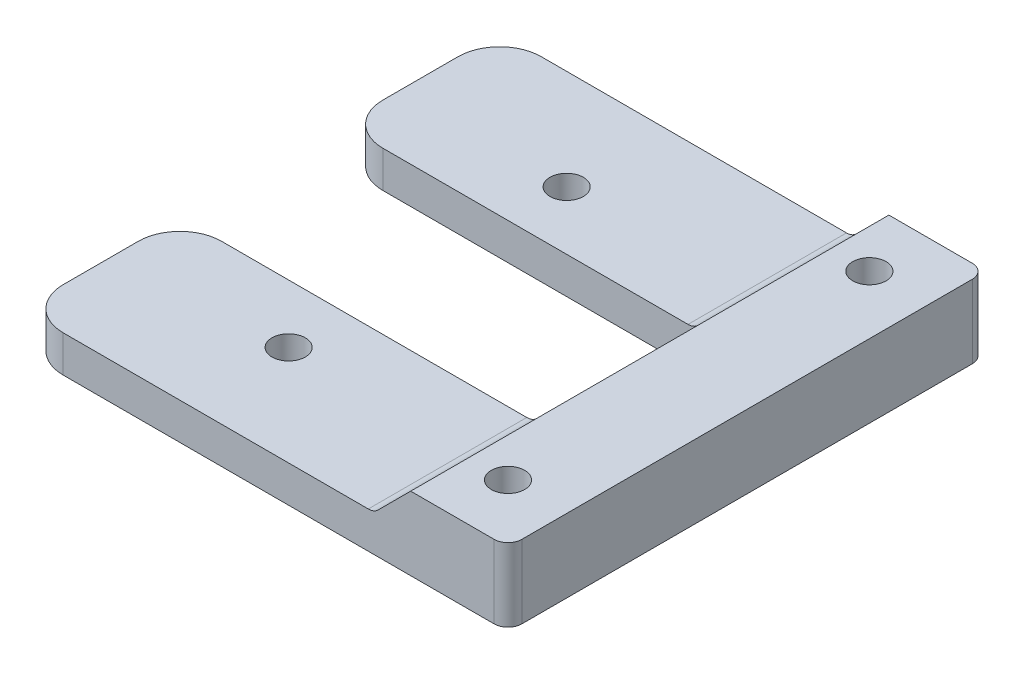
ISO-10303-21;
HEADER;
FILE_DESCRIPTION(('STEP AP214'),'2;1');
FILE_NAME('part.step','',(''),(''),'','','');
FILE_SCHEMA(('AUTOMOTIVE_DESIGN { 1 0 10303 214 1 1 1 1 }'));
ENDSEC;
DATA;
#1=APPLICATION_CONTEXT('core data for automotive mechanical design processes');
#2=APPLICATION_PROTOCOL_DEFINITION('international standard','automotive_design',2000,#1);
#3=PRODUCT_CONTEXT('',#1,'mechanical');
#4=PRODUCT('Part','Part','',(#3));
#5=PRODUCT_RELATED_PRODUCT_CATEGORY('part','',(#4));
#6=PRODUCT_DEFINITION_FORMATION('','',#4);
#7=PRODUCT_DEFINITION_CONTEXT('part definition',#1,'design');
#8=PRODUCT_DEFINITION('design','',#6,#7);
#9=PRODUCT_DEFINITION_SHAPE('','',#8);
#10=(LENGTH_UNIT() NAMED_UNIT(*) SI_UNIT(.MILLI.,.METRE.));
#11=(NAMED_UNIT(*) PLANE_ANGLE_UNIT() SI_UNIT($,.RADIAN.));
#12=(NAMED_UNIT(*) SI_UNIT($,.STERADIAN.) SOLID_ANGLE_UNIT());
#13=UNCERTAINTY_MEASURE_WITH_UNIT(LENGTH_MEASURE(1.E-05),#10,'distance_accuracy_value','');
#14=(GEOMETRIC_REPRESENTATION_CONTEXT(3) GLOBAL_UNCERTAINTY_ASSIGNED_CONTEXT((#13)) GLOBAL_UNIT_ASSIGNED_CONTEXT((#10,
#11,#12)) REPRESENTATION_CONTEXT('',''));
#15=CARTESIAN_POINT('',(0.,0.,0.));
#16=DIRECTION('',(0.,0.,1.));
#17=DIRECTION('',(1.,0.,0.));
#18=AXIS2_PLACEMENT_3D('',#15,#16,#17);
#19=CARTESIAN_POINT('',(0.,-2.635,17.2));
#20=DIRECTION('',(0.,-1.,0.));
#21=DIRECTION('',(1.,0.,0.));
#22=AXIS2_PLACEMENT_3D('',#19,#20,#21);
#23=PLANE('',#22);
#24=CARTESIAN_POINT('',(-22.979761,-2.635,10.0000000000004));
#25=DIRECTION('',(0.,1.,0.));
#26=DIRECTION('',(-1.,0.,0.));
#27=AXIS2_PLACEMENT_3D('',#24,#25,#26);
#28=CIRCLE('',#27,1.2);
#29=CARTESIAN_POINT('',(-24.179761,-2.635,10.0000000000004));
#30=VERTEX_POINT('',#29);
#31=EDGE_CURVE('E846',#30,#30,#28,.T.);
#32=ORIENTED_EDGE('',*,*,#31,.F.);
#33=EDGE_LOOP('',(#32));
#34=FACE_BOUND('',#33,.T.);
#35=DIRECTION('',(0.,0.,-1.));
#36=VECTOR('',#35,1.);
#37=CARTESIAN_POINT('',(-35.,-2.63500000000002,17.2));
#38=LINE('',#37,#36);
#39=CARTESIAN_POINT('',(-35.,-2.63500000000002,14.2));
#40=VERTEX_POINT('',#39);
#41=CARTESIAN_POINT('',(-35.,-2.63500000000002,8.8));
#42=VERTEX_POINT('',#41);
#43=EDGE_CURVE('E226',#40,#42,#38,.T.);
#44=ORIENTED_EDGE('',*,*,#43,.F.);
#45=CARTESIAN_POINT('',(-32.,-2.63500000000002,14.2));
#46=DIRECTION('',(0.,-1.,0.));
#47=DIRECTION('',(1.,0.,0.));
#48=AXIS2_PLACEMENT_3D('',#45,#46,#47);
#49=CIRCLE('',#48,3.);
#50=CARTESIAN_POINT('',(-32.,-2.63500000000002,17.2));
#51=VERTEX_POINT('',#50);
#52=EDGE_CURVE('E312',#40,#51,#49,.F.);
#53=ORIENTED_EDGE('',*,*,#52,.T.);
#54=DIRECTION('',(-1.,0.,0.));
#55=VECTOR('',#54,1.);
#56=CARTESIAN_POINT('',(0.,-2.635,17.2));
#57=LINE('',#56,#55);
#58=CARTESIAN_POINT('',(-10.0492135623731,-2.635,17.2));
#59=VERTEX_POINT('',#58);
#60=EDGE_CURVE('E375',#59,#51,#57,.T.);
#61=ORIENTED_EDGE('',*,*,#60,.F.);
#62=DIRECTION('',(0.,0.,1.));
#63=VECTOR('',#62,1.);
#64=CARTESIAN_POINT('',(-10.0492135623731,-2.635,5.8));
#65=LINE('',#64,#63);
#66=CARTESIAN_POINT('',(-10.0492135623731,-2.635,5.8));
#67=VERTEX_POINT('',#66);
#68=EDGE_CURVE('E233',#59,#67,#65,.F.);
#69=ORIENTED_EDGE('',*,*,#68,.T.);
#70=DIRECTION('',(1.,0.,0.));
#71=VECTOR('',#70,1.);
#72=CARTESIAN_POINT('',(-35.,-2.635,5.8));
#73=LINE('',#72,#71);
#74=CARTESIAN_POINT('',(-32.,-2.635,5.8));
#75=VERTEX_POINT('',#74);
#76=EDGE_CURVE('E432',#75,#67,#73,.T.);
#77=ORIENTED_EDGE('',*,*,#76,.F.);
#78=CARTESIAN_POINT('',(-32.,-2.63500000000002,8.8));
#79=DIRECTION('',(0.,-1.,0.));
#80=DIRECTION('',(1.,0.,0.));
#81=AXIS2_PLACEMENT_3D('',#78,#79,#80);
#82=CIRCLE('',#81,3.);
#83=EDGE_CURVE('E309',#75,#42,#82,.F.);
#84=ORIENTED_EDGE('',*,*,#83,.T.);
#85=EDGE_LOOP('',(#44,#53,#61,#69,#77,#84));
#86=FACE_BOUND('',#85,.T.);
#87=ADVANCED_FACE('F47',(#34,#86),#23,.F.);
#88=CARTESIAN_POINT('',(-35.,0.,17.2));
#89=DIRECTION('',(1.,0.,0.));
#90=DIRECTION('',(0.,0.,-1.));
#91=AXIS2_PLACEMENT_3D('',#88,#89,#90);
#92=PLANE('',#91);
#93=DIRECTION('',(0.,0.,-1.));
#94=VECTOR('',#93,1.);
#95=CARTESIAN_POINT('',(-35.,-5.27,17.2));
#96=LINE('',#95,#94);
#97=CARTESIAN_POINT('',(-35.,-5.27,14.2));
#98=VERTEX_POINT('',#97);
#99=CARTESIAN_POINT('',(-35.,-5.27,8.8));
#100=VERTEX_POINT('',#99);
#101=EDGE_CURVE('E395',#98,#100,#96,.T.);
#102=ORIENTED_EDGE('',*,*,#101,.F.);
#103=DIRECTION('',(0.,-1.,0.));
#104=VECTOR('',#103,1.);
#105=CARTESIAN_POINT('',(-35.,-2.63500000000002,14.2));
#106=LINE('',#105,#104);
#107=EDGE_CURVE('E306',#98,#40,#106,.F.);
#108=ORIENTED_EDGE('',*,*,#107,.T.);
#109=ORIENTED_EDGE('',*,*,#43,.T.);
#110=DIRECTION('',(0.,1.,0.));
#111=VECTOR('',#110,1.);
#112=CARTESIAN_POINT('',(-35.,0.,8.8));
#113=LINE('',#112,#111);
#114=EDGE_CURVE('E303',#42,#100,#113,.F.);
#115=ORIENTED_EDGE('',*,*,#114,.T.);
#116=EDGE_LOOP('',(#102,#108,#109,#115));
#117=FACE_BOUND('',#116,.T.);
#118=ADVANCED_FACE('F410',(#117),#92,.F.);
#119=CARTESIAN_POINT('',(-22.979761,-2.635,-9.99999999999957));
#120=DIRECTION('',(0.,1.,0.));
#121=DIRECTION('',(-1.,0.,0.));
#122=AXIS2_PLACEMENT_3D('',#119,#120,#121);
#123=CIRCLE('',#122,1.2);
#124=CARTESIAN_POINT('',(-24.179761,-2.635,-9.99999999999957));
#125=VERTEX_POINT('',#124);
#126=EDGE_CURVE('E493',#125,#125,#123,.T.);
#127=ORIENTED_EDGE('',*,*,#126,.F.);
#128=EDGE_LOOP('',(#127));
#129=FACE_BOUND('',#128,.T.);
#130=CARTESIAN_POINT('',(-35.,-2.63500000000002,-8.8));
#131=VERTEX_POINT('',#130);
#132=CARTESIAN_POINT('',(-35.,-2.63500000000002,-14.2));
#133=VERTEX_POINT('',#132);
#134=EDGE_CURVE('E398',#131,#133,#38,.T.);
#135=ORIENTED_EDGE('',*,*,#134,.F.);
#136=CARTESIAN_POINT('',(-32.,-2.63500000000002,-8.8));
#137=DIRECTION('',(0.,-1.,0.));
#138=DIRECTION('',(1.,0.,0.));
#139=AXIS2_PLACEMENT_3D('',#136,#137,#138);
#140=CIRCLE('',#139,3.);
#141=CARTESIAN_POINT('',(-32.,-2.635,-5.8));
#142=VERTEX_POINT('',#141);
#143=EDGE_CURVE('E330',#131,#142,#140,.F.);
#144=ORIENTED_EDGE('',*,*,#143,.T.);
#145=DIRECTION('',(-1.,0.,0.));
#146=VECTOR('',#145,1.);
#147=CARTESIAN_POINT('',(-35.,-2.635,-5.8));
#148=LINE('',#147,#146);
#149=CARTESIAN_POINT('',(-10.0492135623731,-2.635,-5.8));
#150=VERTEX_POINT('',#149);
#151=EDGE_CURVE('E426',#150,#142,#148,.T.);
#152=ORIENTED_EDGE('',*,*,#151,.F.);
#153=DIRECTION('',(0.,0.,1.));
#154=VECTOR('',#153,1.);
#155=CARTESIAN_POINT('',(-10.0492135623731,-2.635,-17.2));
#156=LINE('',#155,#154);
#157=CARTESIAN_POINT('',(-10.0492135623731,-2.635,-17.2));
#158=VERTEX_POINT('',#157);
#159=EDGE_CURVE('E239',#150,#158,#156,.F.);
#160=ORIENTED_EDGE('',*,*,#159,.T.);
#161=DIRECTION('',(-1.,0.,0.));
#162=VECTOR('',#161,1.);
#163=CARTESIAN_POINT('',(0.,-2.635,-17.2));
#164=LINE('',#163,#162);
#165=CARTESIAN_POINT('',(-32.,-2.63500000000002,-17.2));
#166=VERTEX_POINT('',#165);
#167=EDGE_CURVE('E382',#158,#166,#164,.T.);
#168=ORIENTED_EDGE('',*,*,#167,.T.);
#169=CARTESIAN_POINT('',(-32.,-2.63500000000002,-14.2));
#170=DIRECTION('',(0.,-1.,0.));
#171=DIRECTION('',(1.,0.,0.));
#172=AXIS2_PLACEMENT_3D('',#169,#170,#171);
#173=CIRCLE('',#172,3.);
#174=EDGE_CURVE('E327',#166,#133,#173,.F.);
#175=ORIENTED_EDGE('',*,*,#174,.T.);
#176=EDGE_LOOP('',(#135,#144,#152,#160,#168,#175));
#177=FACE_BOUND('',#176,.T.);
#178=ADVANCED_FACE('F477',(#129,#177),#23,.F.);
#179=CARTESIAN_POINT('',(-35.,-5.27,-8.8));
#180=VERTEX_POINT('',#179);
#181=CARTESIAN_POINT('',(-35.,-5.27,-14.2));
#182=VERTEX_POINT('',#181);
#183=EDGE_CURVE('E394',#180,#182,#96,.T.);
#184=ORIENTED_EDGE('',*,*,#183,.F.);
#185=DIRECTION('',(0.,1.,0.));
#186=VECTOR('',#185,1.);
#187=CARTESIAN_POINT('',(-35.,0.,-8.8));
#188=LINE('',#187,#186);
#189=EDGE_CURVE('E323',#180,#131,#188,.T.);
#190=ORIENTED_EDGE('',*,*,#189,.T.);
#191=ORIENTED_EDGE('',*,*,#134,.T.);
#192=DIRECTION('',(0.,-1.,0.));
#193=VECTOR('',#192,1.);
#194=CARTESIAN_POINT('',(-35.,0.,-14.2));
#195=LINE('',#194,#193);
#196=EDGE_CURVE('E319',#133,#182,#195,.T.);
#197=ORIENTED_EDGE('',*,*,#196,.T.);
#198=EDGE_LOOP('',(#184,#190,#191,#197));
#199=FACE_BOUND('',#198,.T.);
#200=ADVANCED_FACE('F482',(#199),#92,.F.);
#201=CARTESIAN_POINT('',(0.,-5.27,17.2));
#202=DIRECTION('',(0.,-1.,0.));
#203=DIRECTION('',(1.,0.,0.));
#204=AXIS2_PLACEMENT_3D('',#201,#202,#203);
#205=PLANE('',#204);
#206=CARTESIAN_POINT('',(-22.979761,-5.27,10.0000000000004));
#207=DIRECTION('',(0.,-1.,0.));
#208=DIRECTION('',(1.,0.,0.));
#209=AXIS2_PLACEMENT_3D('',#206,#207,#208);
#210=CIRCLE('',#209,1.2);
#211=CARTESIAN_POINT('',(-21.779761,-5.27,10.0000000000004));
#212=VERTEX_POINT('',#211);
#213=EDGE_CURVE('E837',#212,#212,#210,.F.);
#214=ORIENTED_EDGE('',*,*,#213,.T.);
#215=EDGE_LOOP('',(#214));
#216=FACE_BOUND('',#215,.T.);
#217=CARTESIAN_POINT('',(-22.979761,-5.27,-9.99999999999957));
#218=DIRECTION('',(0.,-1.,0.));
#219=DIRECTION('',(1.,0.,0.));
#220=AXIS2_PLACEMENT_3D('',#217,#218,#219);
#221=CIRCLE('',#220,1.2);
#222=CARTESIAN_POINT('',(-21.779761,-5.27,-9.99999999999957));
#223=VERTEX_POINT('',#222);
#224=EDGE_CURVE('E435',#223,#223,#221,.F.);
#225=ORIENTED_EDGE('',*,*,#224,.T.);
#226=EDGE_LOOP('',(#225));
#227=FACE_BOUND('',#226,.T.);
#228=DIRECTION('',(0.,0.,-1.));
#229=VECTOR('',#228,1.);
#230=CARTESIAN_POINT('',(0.,-5.27,17.2));
#231=LINE('',#230,#229);
#232=CARTESIAN_POINT('',(0.,-5.27,16.2));
#233=VERTEX_POINT('',#232);
#234=CARTESIAN_POINT('',(0.,-5.27,-16.2));
#235=VERTEX_POINT('',#234);
#236=EDGE_CURVE('E365',#233,#235,#231,.T.);
#237=ORIENTED_EDGE('',*,*,#236,.F.);
#238=CARTESIAN_POINT('',(-1.,-5.27,16.2));
#239=DIRECTION('',(0.,-1.,0.));
#240=DIRECTION('',(1.,0.,0.));
#241=AXIS2_PLACEMENT_3D('',#238,#239,#240);
#242=CIRCLE('',#241,1.);
#243=CARTESIAN_POINT('',(-1.,-5.27,17.2));
#244=VERTEX_POINT('',#243);
#245=EDGE_CURVE('E349',#233,#244,#242,.T.);
#246=ORIENTED_EDGE('',*,*,#245,.T.);
#247=DIRECTION('',(-1.,0.,0.));
#248=VECTOR('',#247,1.);
#249=CARTESIAN_POINT('',(0.,-5.27,17.2));
#250=LINE('',#249,#248);
#251=CARTESIAN_POINT('',(-32.,-5.27,17.2));
#252=VERTEX_POINT('',#251);
#253=EDGE_CURVE('E200',#244,#252,#250,.T.);
#254=ORIENTED_EDGE('',*,*,#253,.T.);
#255=CARTESIAN_POINT('',(-32.,-5.27,14.2));
#256=DIRECTION('',(0.,-1.,0.));
#257=DIRECTION('',(1.,0.,0.));
#258=AXIS2_PLACEMENT_3D('',#255,#256,#257);
#259=CIRCLE('',#258,3.);
#260=EDGE_CURVE('E300',#252,#98,#259,.T.);
#261=ORIENTED_EDGE('',*,*,#260,.T.);
#262=ORIENTED_EDGE('',*,*,#101,.T.);
#263=CARTESIAN_POINT('',(-32.,-5.27,8.8));
#264=DIRECTION('',(0.,-1.,0.));
#265=DIRECTION('',(1.,0.,0.));
#266=AXIS2_PLACEMENT_3D('',#263,#264,#265);
#267=CIRCLE('',#266,3.);
#268=CARTESIAN_POINT('',(-32.,-5.27,5.8));
#269=VERTEX_POINT('',#268);
#270=EDGE_CURVE('E297',#100,#269,#267,.T.);
#271=ORIENTED_EDGE('',*,*,#270,.T.);
#272=DIRECTION('',(1.,0.,0.));
#273=VECTOR('',#272,1.);
#274=CARTESIAN_POINT('',(-35.,-5.27,5.8));
#275=LINE('',#274,#273);
#276=CARTESIAN_POINT('',(-8.,-5.27,5.8));
#277=VERTEX_POINT('',#276);
#278=EDGE_CURVE('E419',#269,#277,#275,.T.);
#279=ORIENTED_EDGE('',*,*,#278,.T.);
#280=CARTESIAN_POINT('',(-8.,-5.27,4.8));
#281=DIRECTION('',(0.,-1.,0.));
#282=DIRECTION('',(1.,0.,0.));
#283=AXIS2_PLACEMENT_3D('',#280,#281,#282);
#284=CIRCLE('',#283,1.);
#285=CARTESIAN_POINT('',(-7.,-5.27,4.8));
#286=VERTEX_POINT('',#285);
#287=EDGE_CURVE('E283',#277,#286,#284,.F.);
#288=ORIENTED_EDGE('',*,*,#287,.T.);
#289=DIRECTION('',(0.,0.,-1.));
#290=VECTOR('',#289,1.);
#291=CARTESIAN_POINT('',(-7.,-5.27,5.8));
#292=LINE('',#291,#290);
#293=CARTESIAN_POINT('',(-7.,-5.27,-4.8));
#294=VERTEX_POINT('',#293);
#295=EDGE_CURVE('E427',#286,#294,#292,.T.);
#296=ORIENTED_EDGE('',*,*,#295,.T.);
#297=CARTESIAN_POINT('',(-8.,-5.27,-4.8));
#298=DIRECTION('',(0.,-1.,0.));
#299=DIRECTION('',(1.,0.,0.));
#300=AXIS2_PLACEMENT_3D('',#297,#298,#299);
#301=CIRCLE('',#300,1.);
#302=CARTESIAN_POINT('',(-8.,-5.27,-5.8));
#303=VERTEX_POINT('',#302);
#304=EDGE_CURVE('E277',#294,#303,#301,.F.);
#305=ORIENTED_EDGE('',*,*,#304,.T.);
#306=DIRECTION('',(-1.,0.,0.));
#307=VECTOR('',#306,1.);
#308=CARTESIAN_POINT('',(-35.,-5.27,-5.8));
#309=LINE('',#308,#307);
#310=CARTESIAN_POINT('',(-32.,-5.27,-5.8));
#311=VERTEX_POINT('',#310);
#312=EDGE_CURVE('E441',#303,#311,#309,.T.);
#313=ORIENTED_EDGE('',*,*,#312,.T.);
#314=CARTESIAN_POINT('',(-32.,-5.27,-8.8));
#315=DIRECTION('',(0.,-1.,0.));
#316=DIRECTION('',(1.,0.,0.));
#317=AXIS2_PLACEMENT_3D('',#314,#315,#316);
#318=CIRCLE('',#317,3.);
#319=EDGE_CURVE('E294',#311,#180,#318,.T.);
#320=ORIENTED_EDGE('',*,*,#319,.T.);
#321=ORIENTED_EDGE('',*,*,#183,.T.);
#322=CARTESIAN_POINT('',(-32.,-5.27,-14.2));
#323=DIRECTION('',(0.,-1.,0.));
#324=DIRECTION('',(1.,0.,0.));
#325=AXIS2_PLACEMENT_3D('',#322,#323,#324);
#326=CIRCLE('',#325,3.);
#327=CARTESIAN_POINT('',(-32.,-5.27,-17.2));
#328=VERTEX_POINT('',#327);
#329=EDGE_CURVE('E290',#182,#328,#326,.T.);
#330=ORIENTED_EDGE('',*,*,#329,.T.);
#331=DIRECTION('',(-1.,0.,0.));
#332=VECTOR('',#331,1.);
#333=CARTESIAN_POINT('',(0.,-5.27,-17.2));
#334=LINE('',#333,#332);
#335=CARTESIAN_POINT('',(-1.,-5.27,-17.2));
#336=VERTEX_POINT('',#335);
#337=EDGE_CURVE('E386',#336,#328,#334,.T.);
#338=ORIENTED_EDGE('',*,*,#337,.F.);
#339=CARTESIAN_POINT('',(-1.,-5.27,-16.2));
#340=DIRECTION('',(0.,-1.,0.));
#341=DIRECTION('',(1.,0.,0.));
#342=AXIS2_PLACEMENT_3D('',#339,#340,#341);
#343=CIRCLE('',#342,1.);
#344=EDGE_CURVE('E346',#336,#235,#343,.T.);
#345=ORIENTED_EDGE('',*,*,#344,.T.);
#346=EDGE_LOOP('',(#237,#246,#254,#261,#262,#271,#279,#288,#296,#305,#313,#320,#321,#330,#338,#345));
#347=FACE_BOUND('',#346,.T.);
#348=CARTESIAN_POINT('',(-4.2,-5.27,-13.));
#349=DIRECTION('',(0.,-1.,0.));
#350=DIRECTION('',(1.,0.,0.));
#351=AXIS2_PLACEMENT_3D('',#348,#349,#350);
#352=CIRCLE('',#351,1.2);
#353=CARTESIAN_POINT('',(-3.,-5.27,-13.));
#354=VERTEX_POINT('',#353);
#355=EDGE_CURVE('E449',#354,#354,#352,.F.);
#356=ORIENTED_EDGE('',*,*,#355,.T.);
#357=EDGE_LOOP('',(#356));
#358=FACE_BOUND('',#357,.T.);
#359=CARTESIAN_POINT('',(-4.2,-5.27,13.));
#360=DIRECTION('',(0.,-1.,0.));
#361=DIRECTION('',(1.,0.,0.));
#362=AXIS2_PLACEMENT_3D('',#359,#360,#361);
#363=CIRCLE('',#362,1.2);
#364=CARTESIAN_POINT('',(-3.,-5.27,13.));
#365=VERTEX_POINT('',#364);
#366=EDGE_CURVE('E453',#365,#365,#363,.F.);
#367=ORIENTED_EDGE('',*,*,#366,.T.);
#368=EDGE_LOOP('',(#367));
#369=FACE_BOUND('',#368,.T.);
#370=ADVANCED_FACE('F369',(#216,#227,#347,#358,#369),#205,.T.);
#371=CARTESIAN_POINT('',(0.,0.,17.2));
#372=DIRECTION('',(1.,0.,0.));
#373=DIRECTION('',(0.,0.,-1.));
#374=AXIS2_PLACEMENT_3D('',#371,#372,#373);
#375=PLANE('',#374);
#376=DIRECTION('',(0.,0.,-1.));
#377=VECTOR('',#376,1.);
#378=CARTESIAN_POINT('',(0.,0.,17.2));
#379=LINE('',#378,#377);
#380=CARTESIAN_POINT('',(0.,0.,16.2));
#381=VERTEX_POINT('',#380);
#382=CARTESIAN_POINT('',(0.,0.,-16.2));
#383=VERTEX_POINT('',#382);
#384=EDGE_CURVE('E210',#381,#383,#379,.T.);
#385=ORIENTED_EDGE('',*,*,#384,.F.);
#386=DIRECTION('',(0.,-1.,0.));
#387=VECTOR('',#386,1.);
#388=CARTESIAN_POINT('',(0.,0.,16.2));
#389=LINE('',#388,#387);
#390=EDGE_CURVE('E342',#381,#233,#389,.T.);
#391=ORIENTED_EDGE('',*,*,#390,.T.);
#392=ORIENTED_EDGE('',*,*,#236,.T.);
#393=DIRECTION('',(0.,-1.,0.));
#394=VECTOR('',#393,1.);
#395=CARTESIAN_POINT('',(0.,0.,-16.2));
#396=LINE('',#395,#394);
#397=EDGE_CURVE('E339',#235,#383,#396,.F.);
#398=ORIENTED_EDGE('',*,*,#397,.T.);
#399=EDGE_LOOP('',(#385,#391,#392,#398));
#400=FACE_BOUND('',#399,.T.);
#401=ADVANCED_FACE('F360',(#400),#375,.T.);
#402=CARTESIAN_POINT('',(0.,0.,17.2));
#403=DIRECTION('',(0.,-1.,0.));
#404=DIRECTION('',(1.,0.,0.));
#405=AXIS2_PLACEMENT_3D('',#402,#403,#404);
#406=PLANE('',#405);
#407=CARTESIAN_POINT('',(-4.2,0.,-13.));
#408=DIRECTION('',(0.,1.,0.));
#409=DIRECTION('',(0.,0.,1.));
#410=AXIS2_PLACEMENT_3D('',#407,#408,#409);
#411=CIRCLE('',#410,1.2);
#412=CARTESIAN_POINT('',(-4.2,0.,-11.8));
#413=VERTEX_POINT('',#412);
#414=EDGE_CURVE('E387',#413,#413,#411,.T.);
#415=ORIENTED_EDGE('',*,*,#414,.F.);
#416=EDGE_LOOP('',(#415));
#417=FACE_BOUND('',#416,.T.);
#418=CARTESIAN_POINT('',(-4.2,0.,13.));
#419=DIRECTION('',(0.,1.,0.));
#420=DIRECTION('',(0.,0.,1.));
#421=AXIS2_PLACEMENT_3D('',#418,#419,#420);
#422=CIRCLE('',#421,1.2);
#423=CARTESIAN_POINT('',(-4.2,0.,14.2));
#424=VERTEX_POINT('',#423);
#425=EDGE_CURVE('E445',#424,#424,#422,.T.);
#426=ORIENTED_EDGE('',*,*,#425,.F.);
#427=EDGE_LOOP('',(#426));
#428=FACE_BOUND('',#427,.T.);
#429=DIRECTION('',(-1.,0.,0.));
#430=VECTOR('',#429,1.);
#431=CARTESIAN_POINT('',(0.,0.,17.2));
#432=LINE('',#431,#430);
#433=CARTESIAN_POINT('',(-1.,0.,17.2));
#434=VERTEX_POINT('',#433);
#435=CARTESIAN_POINT('',(-7.,0.,17.2));
#436=VERTEX_POINT('',#435);
#437=EDGE_CURVE('E191',#434,#436,#432,.T.);
#438=ORIENTED_EDGE('',*,*,#437,.F.);
#439=CARTESIAN_POINT('',(-1.,0.,16.2));
#440=DIRECTION('',(0.,-1.,0.));
#441=DIRECTION('',(1.,0.,0.));
#442=AXIS2_PLACEMENT_3D('',#439,#440,#441);
#443=CIRCLE('',#442,1.);
#444=EDGE_CURVE('E56',#434,#381,#443,.F.);
#445=ORIENTED_EDGE('',*,*,#444,.T.);
#446=ORIENTED_EDGE('',*,*,#384,.T.);
#447=CARTESIAN_POINT('',(-1.,0.,-16.2));
#448=DIRECTION('',(0.,-1.,0.));
#449=DIRECTION('',(1.,0.,0.));
#450=AXIS2_PLACEMENT_3D('',#447,#448,#449);
#451=CIRCLE('',#450,1.);
#452=CARTESIAN_POINT('',(-1.,0.,-17.2));
#453=VERTEX_POINT('',#452);
#454=EDGE_CURVE('E63',#383,#453,#451,.F.);
#455=ORIENTED_EDGE('',*,*,#454,.T.);
#456=DIRECTION('',(-1.,0.,0.));
#457=VECTOR('',#456,1.);
#458=CARTESIAN_POINT('',(0.,0.,-17.2));
#459=LINE('',#458,#457);
#460=CARTESIAN_POINT('',(-7.,0.,-17.2));
#461=VERTEX_POINT('',#460);
#462=EDGE_CURVE('E378',#453,#461,#459,.T.);
#463=ORIENTED_EDGE('',*,*,#462,.T.);
#464=DIRECTION('',(0.,0.,-1.));
#465=VECTOR('',#464,1.);
#466=CARTESIAN_POINT('',(-7.,0.,17.2));
#467=LINE('',#466,#465);
#468=CARTESIAN_POINT('',(-7.,0.,-4.79999999999999));
#469=VERTEX_POINT('',#468);
#470=EDGE_CURVE('E199',#469,#461,#467,.T.);
#471=ORIENTED_EDGE('',*,*,#470,.F.);
#472=CARTESIAN_POINT('',(-7.,0.,4.80000000000001));
#473=VERTEX_POINT('',#472);
#474=EDGE_CURVE('E206',#473,#469,#467,.T.);
#475=ORIENTED_EDGE('',*,*,#474,.F.);
#476=EDGE_CURVE('E203',#436,#473,#467,.T.);
#477=ORIENTED_EDGE('',*,*,#476,.F.);
#478=EDGE_LOOP('',(#438,#445,#446,#455,#463,#471,#475,#477));
#479=FACE_BOUND('',#478,.T.);
#480=ADVANCED_FACE('F204',(#417,#428,#479),#406,.F.);
#481=CARTESIAN_POINT('',(-7.,0.,17.2));
#482=DIRECTION('',(1.,0.,0.));
#483=DIRECTION('',(0.,0.,-1.));
#484=AXIS2_PLACEMENT_3D('',#481,#482,#483);
#485=PLANE('',#484);
#486=ORIENTED_EDGE('',*,*,#474,.T.);
#487=DIRECTION('',(0.,1.,0.));
#488=VECTOR('',#487,1.);
#489=CARTESIAN_POINT('',(-7.,-5.27,-4.8));
#490=LINE('',#489,#488);
#491=EDGE_CURVE('E254',#469,#294,#490,.F.);
#492=ORIENTED_EDGE('',*,*,#491,.T.);
#493=ORIENTED_EDGE('',*,*,#295,.F.);
#494=DIRECTION('',(0.,1.,0.));
#495=VECTOR('',#494,1.);
#496=CARTESIAN_POINT('',(-7.,0.,4.8));
#497=LINE('',#496,#495);
#498=EDGE_CURVE('E250',#286,#473,#497,.T.);
#499=ORIENTED_EDGE('',*,*,#498,.T.);
#500=EDGE_LOOP('',(#486,#492,#493,#499));
#501=FACE_BOUND('',#500,.T.);
#502=ADVANCED_FACE('F463',(#501),#485,.F.);
#503=CARTESIAN_POINT('',(0.,0.,17.2));
#504=DIRECTION('',(0.,0.,1.));
#505=DIRECTION('',(1.,0.,0.));
#506=AXIS2_PLACEMENT_3D('',#503,#504,#505);
#507=PLANE('',#506);
#508=ORIENTED_EDGE('',*,*,#253,.F.);
#509=DIRECTION('',(0.,-1.,0.));
#510=VECTOR('',#509,1.);
#511=CARTESIAN_POINT('',(-1.,0.,17.2));
#512=LINE('',#511,#510);
#513=EDGE_CURVE('E71',#244,#434,#512,.F.);
#514=ORIENTED_EDGE('',*,*,#513,.T.);
#515=ORIENTED_EDGE('',*,*,#437,.T.);
#516=DIRECTION('',(0.707106781186547,0.707106781186548,0.));
#517=VECTOR('',#516,1.);
#518=CARTESIAN_POINT('',(-9.63499999999999,-2.635,17.2));
#519=LINE('',#518,#517);
#520=CARTESIAN_POINT('',(-9.34210678118654,-2.34210678118655,17.2));
#521=VERTEX_POINT('',#520);
#522=EDGE_CURVE('E195',#436,#521,#519,.F.);
#523=ORIENTED_EDGE('',*,*,#522,.T.);
#524=CARTESIAN_POINT('',(-10.0492135623731,-1.635,17.2));
#525=DIRECTION('',(0.,0.,1.));
#526=DIRECTION('',(1.,0.,0.));
#527=AXIS2_PLACEMENT_3D('',#524,#525,#526);
#528=CIRCLE('',#527,1.);
#529=EDGE_CURVE('E264',#521,#59,#528,.F.);
#530=ORIENTED_EDGE('',*,*,#529,.T.);
#531=ORIENTED_EDGE('',*,*,#60,.T.);
#532=DIRECTION('',(0.,-1.,0.));
#533=VECTOR('',#532,1.);
#534=CARTESIAN_POINT('',(-32.,-5.27,17.2));
#535=LINE('',#534,#533);
#536=EDGE_CURVE('E286',#51,#252,#535,.T.);
#537=ORIENTED_EDGE('',*,*,#536,.T.);
#538=EDGE_LOOP('',(#508,#514,#515,#523,#530,#531,#537));
#539=FACE_BOUND('',#538,.T.);
#540=ADVANCED_FACE('F193',(#539),#507,.T.);
#541=CARTESIAN_POINT('',(0.,0.,-17.2));
#542=DIRECTION('',(0.,0.,1.));
#543=DIRECTION('',(1.,0.,0.));
#544=AXIS2_PLACEMENT_3D('',#541,#542,#543);
#545=PLANE('',#544);
#546=ORIENTED_EDGE('',*,*,#462,.F.);
#547=DIRECTION('',(0.,-1.,0.));
#548=VECTOR('',#547,1.);
#549=CARTESIAN_POINT('',(-1.,-5.27,-17.2));
#550=LINE('',#549,#548);
#551=EDGE_CURVE('E11',#453,#336,#550,.T.);
#552=ORIENTED_EDGE('',*,*,#551,.T.);
#553=ORIENTED_EDGE('',*,*,#337,.T.);
#554=DIRECTION('',(0.,-1.,0.));
#555=VECTOR('',#554,1.);
#556=CARTESIAN_POINT('',(-32.,0.,-17.2));
#557=LINE('',#556,#555);
#558=EDGE_CURVE('E336',#328,#166,#557,.F.);
#559=ORIENTED_EDGE('',*,*,#558,.T.);
#560=ORIENTED_EDGE('',*,*,#167,.F.);
#561=CARTESIAN_POINT('',(-10.0492135623731,-1.635,-17.2));
#562=DIRECTION('',(0.,0.,1.));
#563=DIRECTION('',(1.,0.,0.));
#564=AXIS2_PLACEMENT_3D('',#561,#562,#563);
#565=CIRCLE('',#564,1.);
#566=CARTESIAN_POINT('',(-9.34210678118654,-2.34210678118655,-17.2));
#567=VERTEX_POINT('',#566);
#568=EDGE_CURVE('E267',#158,#567,#565,.T.);
#569=ORIENTED_EDGE('',*,*,#568,.T.);
#570=DIRECTION('',(-0.707106781186547,-0.707106781186548,0.));
#571=VECTOR('',#570,1.);
#572=CARTESIAN_POINT('',(-3.49999999999999,3.49999999999999,-17.2));
#573=LINE('',#572,#571);
#574=EDGE_CURVE('E217',#567,#461,#573,.F.);
#575=ORIENTED_EDGE('',*,*,#574,.T.);
#576=EDGE_LOOP('',(#546,#552,#553,#559,#560,#569,#575));
#577=FACE_BOUND('',#576,.T.);
#578=ADVANCED_FACE('F551',(#577),#545,.F.);
#579=CARTESIAN_POINT('',(-4.2,-5.271,13.));
#580=DIRECTION('',(0.,1.,0.));
#581=DIRECTION('',(0.,0.,1.));
#582=AXIS2_PLACEMENT_3D('',#579,#580,#581);
#583=CYLINDRICAL_SURFACE('',#582,1.2);
#584=ORIENTED_EDGE('',*,*,#366,.F.);
#585=EDGE_LOOP('',(#584));
#586=FACE_BOUND('',#585,.T.);
#587=ORIENTED_EDGE('',*,*,#425,.T.);
#588=EDGE_LOOP('',(#587));
#589=FACE_BOUND('',#588,.T.);
#590=ADVANCED_FACE('F460',(#586,#589),#583,.F.);
#591=CARTESIAN_POINT('',(-4.2,-5.271,-13.));
#592=DIRECTION('',(0.,1.,0.));
#593=DIRECTION('',(0.,0.,1.));
#594=AXIS2_PLACEMENT_3D('',#591,#592,#593);
#595=CYLINDRICAL_SURFACE('',#594,1.2);
#596=ORIENTED_EDGE('',*,*,#355,.F.);
#597=EDGE_LOOP('',(#596));
#598=FACE_BOUND('',#597,.T.);
#599=ORIENTED_EDGE('',*,*,#414,.T.);
#600=EDGE_LOOP('',(#599));
#601=FACE_BOUND('',#600,.T.);
#602=ADVANCED_FACE('F596',(#598,#601),#595,.F.);
#603=CARTESIAN_POINT('',(-35.,-5.27100000000001,5.8));
#604=DIRECTION('',(0.,0.,1.));
#605=DIRECTION('',(1.,0.,0.));
#606=AXIS2_PLACEMENT_3D('',#603,#604,#605);
#607=PLANE('',#606);
#608=ORIENTED_EDGE('',*,*,#278,.F.);
#609=DIRECTION('',(0.,1.,0.));
#610=VECTOR('',#609,1.);
#611=CARTESIAN_POINT('',(-32.,-5.27100000000001,5.8));
#612=LINE('',#611,#610);
#613=EDGE_CURVE('E315',#269,#75,#612,.T.);
#614=ORIENTED_EDGE('',*,*,#613,.T.);
#615=ORIENTED_EDGE('',*,*,#76,.T.);
#616=CARTESIAN_POINT('',(-10.0492135623731,-1.635,5.8));
#617=DIRECTION('',(0.,0.,1.));
#618=DIRECTION('',(1.,0.,0.));
#619=AXIS2_PLACEMENT_3D('',#616,#617,#618);
#620=CIRCLE('',#619,1.);
#621=CARTESIAN_POINT('',(-9.34210678118654,-2.34210678118655,5.8));
#622=VERTEX_POINT('',#621);
#623=EDGE_CURVE('E261',#67,#622,#620,.T.);
#624=ORIENTED_EDGE('',*,*,#623,.T.);
#625=DIRECTION('',(-0.707106781186547,-0.707106781186548,0.));
#626=VECTOR('',#625,1.);
#627=CARTESIAN_POINT('',(-23.6355,-16.6355,5.8));
#628=LINE('',#627,#626);
#629=CARTESIAN_POINT('',(-8.,-1.00000000000001,5.8));
#630=VERTEX_POINT('',#629);
#631=EDGE_CURVE('E218',#622,#630,#628,.F.);
#632=ORIENTED_EDGE('',*,*,#631,.T.);
#633=DIRECTION('',(0.,1.,0.));
#634=VECTOR('',#633,1.);
#635=CARTESIAN_POINT('',(-8.,-5.27,5.8));
#636=LINE('',#635,#634);
#637=EDGE_CURVE('E257',#630,#277,#636,.F.);
#638=ORIENTED_EDGE('',*,*,#637,.T.);
#639=EDGE_LOOP('',(#608,#614,#615,#624,#632,#638));
#640=FACE_BOUND('',#639,.T.);
#641=ADVANCED_FACE('F421',(#640),#607,.F.);
#642=CARTESIAN_POINT('',(-35.,-5.27100000000001,-5.8));
#643=DIRECTION('',(0.,0.,-1.));
#644=DIRECTION('',(-1.,0.,0.));
#645=AXIS2_PLACEMENT_3D('',#642,#643,#644);
#646=PLANE('',#645);
#647=ORIENTED_EDGE('',*,*,#151,.T.);
#648=DIRECTION('',(0.,1.,0.));
#649=VECTOR('',#648,1.);
#650=CARTESIAN_POINT('',(-32.,-5.27100000000001,-5.8));
#651=LINE('',#650,#649);
#652=EDGE_CURVE('E333',#142,#311,#651,.F.);
#653=ORIENTED_EDGE('',*,*,#652,.T.);
#654=ORIENTED_EDGE('',*,*,#312,.F.);
#655=DIRECTION('',(0.,1.,0.));
#656=VECTOR('',#655,1.);
#657=CARTESIAN_POINT('',(-8.,0.,-5.8));
#658=LINE('',#657,#656);
#659=CARTESIAN_POINT('',(-8.,-1.00000000000001,-5.8));
#660=VERTEX_POINT('',#659);
#661=EDGE_CURVE('E246',#303,#660,#658,.T.);
#662=ORIENTED_EDGE('',*,*,#661,.T.);
#663=DIRECTION('',(0.707106781186547,0.707106781186548,0.));
#664=VECTOR('',#663,1.);
#665=CARTESIAN_POINT('',(-23.6355,-16.6355,-5.8));
#666=LINE('',#665,#664);
#667=CARTESIAN_POINT('',(-9.34210678118654,-2.34210678118655,-5.8));
#668=VERTEX_POINT('',#667);
#669=EDGE_CURVE('E223',#660,#668,#666,.F.);
#670=ORIENTED_EDGE('',*,*,#669,.T.);
#671=CARTESIAN_POINT('',(-10.0492135623731,-1.635,-5.8));
#672=DIRECTION('',(0.,0.,-1.));
#673=DIRECTION('',(-1.,0.,0.));
#674=AXIS2_PLACEMENT_3D('',#671,#672,#673);
#675=CIRCLE('',#674,1.);
#676=EDGE_CURVE('E270',#668,#150,#675,.T.);
#677=ORIENTED_EDGE('',*,*,#676,.T.);
#678=EDGE_LOOP('',(#647,#653,#654,#662,#670,#677));
#679=FACE_BOUND('',#678,.T.);
#680=ADVANCED_FACE('F558',(#679),#646,.F.);
#681=CARTESIAN_POINT('',(-22.979761,-5.27100000000001,-9.99999999999957));
#682=DIRECTION('',(0.,1.,0.));
#683=DIRECTION('',(-1.,0.,0.));
#684=AXIS2_PLACEMENT_3D('',#681,#682,#683);
#685=CYLINDRICAL_SURFACE('',#684,1.2);
#686=ORIENTED_EDGE('',*,*,#224,.F.);
#687=EDGE_LOOP('',(#686));
#688=FACE_BOUND('',#687,.T.);
#689=ORIENTED_EDGE('',*,*,#126,.T.);
#690=EDGE_LOOP('',(#689));
#691=FACE_BOUND('',#690,.T.);
#692=ADVANCED_FACE('F583',(#688,#691),#685,.F.);
#693=CARTESIAN_POINT('',(-22.979761,-5.27100000000001,10.0000000000004));
#694=DIRECTION('',(0.,1.,0.));
#695=DIRECTION('',(-1.,0.,0.));
#696=AXIS2_PLACEMENT_3D('',#693,#694,#695);
#697=CYLINDRICAL_SURFACE('',#696,1.2);
#698=ORIENTED_EDGE('',*,*,#213,.F.);
#699=EDGE_LOOP('',(#698));
#700=FACE_BOUND('',#699,.T.);
#701=ORIENTED_EDGE('',*,*,#31,.T.);
#702=EDGE_LOOP('',(#701));
#703=FACE_BOUND('',#702,.T.);
#704=ADVANCED_FACE('F579',(#700,#703),#697,.F.);
#705=CARTESIAN_POINT('',(-9.63499999999999,-2.635,17.2));
#706=DIRECTION('',(-0.707106781186548,0.707106781186547,0.));
#707=DIRECTION('',(0.,0.,1.));
#708=AXIS2_PLACEMENT_3D('',#705,#706,#707);
#709=PLANE('',#708);
#710=ORIENTED_EDGE('',*,*,#631,.F.);
#711=DIRECTION('',(0.,0.,-1.));
#712=VECTOR('',#711,1.);
#713=CARTESIAN_POINT('',(-9.34210678118654,-2.34210678118655,17.2));
#714=LINE('',#713,#712);
#715=EDGE_CURVE('E215',#622,#521,#714,.F.);
#716=ORIENTED_EDGE('',*,*,#715,.T.);
#717=ORIENTED_EDGE('',*,*,#522,.F.);
#718=ORIENTED_EDGE('',*,*,#476,.T.);
#719=CARTESIAN_POINT('',(-8.,-1.00000000000001,4.8));
#720=DIRECTION('',(-0.707106781186548,0.707106781186547,0.));
#721=DIRECTION('',(-0.707106781186547,-0.707106781186548,0.));
#722=AXIS2_PLACEMENT_3D('',#719,#720,#721);
#723=ELLIPSE('',#722,1.4142135623731,1.);
#724=EDGE_CURVE('E280',#473,#630,#723,.F.);
#725=ORIENTED_EDGE('',*,*,#724,.T.);
#726=EDGE_LOOP('',(#710,#716,#717,#718,#725));
#727=FACE_BOUND('',#726,.T.);
#728=ADVANCED_FACE('F213',(#727),#709,.T.);
#729=CARTESIAN_POINT('',(-9.63499999999999,-2.635,17.2));
#730=DIRECTION('',(-0.707106781186548,0.707106781186547,0.));
#731=DIRECTION('',(0.,0.,1.));
#732=AXIS2_PLACEMENT_3D('',#729,#730,#731);
#733=PLANE('',#732);
#734=ORIENTED_EDGE('',*,*,#574,.F.);
#735=DIRECTION('',(0.,0.,-1.));
#736=VECTOR('',#735,1.);
#737=CARTESIAN_POINT('',(-9.34210678118654,-2.34210678118655,-5.8));
#738=LINE('',#737,#736);
#739=EDGE_CURVE('E243',#567,#668,#738,.F.);
#740=ORIENTED_EDGE('',*,*,#739,.T.);
#741=ORIENTED_EDGE('',*,*,#669,.F.);
#742=CARTESIAN_POINT('',(-8.,-1.00000000000001,-4.8));
#743=DIRECTION('',(-0.707106781186548,0.707106781186547,0.));
#744=DIRECTION('',(-0.707106781186547,-0.707106781186548,0.));
#745=AXIS2_PLACEMENT_3D('',#742,#743,#744);
#746=ELLIPSE('',#745,1.4142135623731,1.);
#747=EDGE_CURVE('E273',#660,#469,#746,.F.);
#748=ORIENTED_EDGE('',*,*,#747,.T.);
#749=ORIENTED_EDGE('',*,*,#470,.T.);
#750=EDGE_LOOP('',(#734,#740,#741,#748,#749));
#751=FACE_BOUND('',#750,.T.);
#752=ADVANCED_FACE('F511',(#751),#733,.T.);
#753=CARTESIAN_POINT('',(-10.0492135623731,-1.635,17.2));
#754=DIRECTION('',(0.,0.,-1.));
#755=DIRECTION('',(-1.,0.,0.));
#756=AXIS2_PLACEMENT_3D('',#753,#754,#755);
#757=CYLINDRICAL_SURFACE('',#756,1.);
#758=ORIENTED_EDGE('',*,*,#529,.F.);
#759=ORIENTED_EDGE('',*,*,#715,.F.);
#760=ORIENTED_EDGE('',*,*,#623,.F.);
#761=ORIENTED_EDGE('',*,*,#68,.F.);
#762=EDGE_LOOP('',(#758,#759,#760,#761));
#763=FACE_BOUND('',#762,.T.);
#764=ADVANCED_FACE('F522',(#763),#757,.F.);
#765=CARTESIAN_POINT('',(-10.0492135623731,-1.635,17.2));
#766=DIRECTION('',(0.,0.,-1.));
#767=DIRECTION('',(-1.,0.,0.));
#768=AXIS2_PLACEMENT_3D('',#765,#766,#767);
#769=CYLINDRICAL_SURFACE('',#768,1.);
#770=ORIENTED_EDGE('',*,*,#676,.F.);
#771=ORIENTED_EDGE('',*,*,#739,.F.);
#772=ORIENTED_EDGE('',*,*,#568,.F.);
#773=ORIENTED_EDGE('',*,*,#159,.F.);
#774=EDGE_LOOP('',(#770,#771,#772,#773));
#775=FACE_BOUND('',#774,.T.);
#776=ADVANCED_FACE('F555',(#775),#769,.F.);
#777=CARTESIAN_POINT('',(-8.,-5.27100000000001,-4.8));
#778=DIRECTION('',(0.,-1.,0.));
#779=DIRECTION('',(0.,0.,-1.));
#780=AXIS2_PLACEMENT_3D('',#777,#778,#779);
#781=CYLINDRICAL_SURFACE('',#780,1.);
#782=ORIENTED_EDGE('',*,*,#304,.F.);
#783=ORIENTED_EDGE('',*,*,#491,.F.);
#784=ORIENTED_EDGE('',*,*,#747,.F.);
#785=ORIENTED_EDGE('',*,*,#661,.F.);
#786=EDGE_LOOP('',(#782,#783,#784,#785));
#787=FACE_BOUND('',#786,.T.);
#788=ADVANCED_FACE('F534',(#787),#781,.F.);
#789=CARTESIAN_POINT('',(-8.,0.,4.8));
#790=DIRECTION('',(0.,-1.,0.));
#791=DIRECTION('',(0.,0.,-1.));
#792=AXIS2_PLACEMENT_3D('',#789,#790,#791);
#793=CYLINDRICAL_SURFACE('',#792,1.);
#794=ORIENTED_EDGE('',*,*,#287,.F.);
#795=ORIENTED_EDGE('',*,*,#637,.F.);
#796=ORIENTED_EDGE('',*,*,#724,.F.);
#797=ORIENTED_EDGE('',*,*,#498,.F.);
#798=EDGE_LOOP('',(#794,#795,#796,#797));
#799=FACE_BOUND('',#798,.T.);
#800=ADVANCED_FACE('F518',(#799),#793,.F.);
#801=CARTESIAN_POINT('',(-32.,0.,14.2));
#802=DIRECTION('',(0.,1.,0.));
#803=DIRECTION('',(0.,0.,1.));
#804=AXIS2_PLACEMENT_3D('',#801,#802,#803);
#805=CYLINDRICAL_SURFACE('',#804,3.);
#806=ORIENTED_EDGE('',*,*,#52,.F.);
#807=ORIENTED_EDGE('',*,*,#107,.F.);
#808=ORIENTED_EDGE('',*,*,#260,.F.);
#809=ORIENTED_EDGE('',*,*,#536,.F.);
#810=EDGE_LOOP('',(#806,#807,#808,#809));
#811=FACE_BOUND('',#810,.T.);
#812=ADVANCED_FACE('F525',(#811),#805,.T.);
#813=CARTESIAN_POINT('',(-32.,-5.27100000000001,8.8));
#814=DIRECTION('',(0.,1.,0.));
#815=DIRECTION('',(0.,0.,1.));
#816=AXIS2_PLACEMENT_3D('',#813,#814,#815);
#817=CYLINDRICAL_SURFACE('',#816,3.);
#818=ORIENTED_EDGE('',*,*,#270,.F.);
#819=ORIENTED_EDGE('',*,*,#114,.F.);
#820=ORIENTED_EDGE('',*,*,#83,.F.);
#821=ORIENTED_EDGE('',*,*,#613,.F.);
#822=EDGE_LOOP('',(#818,#819,#820,#821));
#823=FACE_BOUND('',#822,.T.);
#824=ADVANCED_FACE('F416',(#823),#817,.T.);
#825=CARTESIAN_POINT('',(-32.,0.,-8.8));
#826=DIRECTION('',(0.,1.,0.));
#827=DIRECTION('',(0.,0.,1.));
#828=AXIS2_PLACEMENT_3D('',#825,#826,#827);
#829=CYLINDRICAL_SURFACE('',#828,3.);
#830=ORIENTED_EDGE('',*,*,#319,.F.);
#831=ORIENTED_EDGE('',*,*,#652,.F.);
#832=ORIENTED_EDGE('',*,*,#143,.F.);
#833=ORIENTED_EDGE('',*,*,#189,.F.);
#834=EDGE_LOOP('',(#830,#831,#832,#833));
#835=FACE_BOUND('',#834,.T.);
#836=ADVANCED_FACE('F532',(#835),#829,.T.);
#837=CARTESIAN_POINT('',(-32.,0.,-14.2));
#838=DIRECTION('',(0.,-1.,0.));
#839=DIRECTION('',(0.,0.,-1.));
#840=AXIS2_PLACEMENT_3D('',#837,#838,#839);
#841=CYLINDRICAL_SURFACE('',#840,3.);
#842=ORIENTED_EDGE('',*,*,#174,.F.);
#843=ORIENTED_EDGE('',*,*,#558,.F.);
#844=ORIENTED_EDGE('',*,*,#329,.F.);
#845=ORIENTED_EDGE('',*,*,#196,.F.);
#846=EDGE_LOOP('',(#842,#843,#844,#845));
#847=FACE_BOUND('',#846,.T.);
#848=ADVANCED_FACE('F499',(#847),#841,.T.);
#849=CARTESIAN_POINT('',(-1.,0.,16.2));
#850=DIRECTION('',(0.,-1.,0.));
#851=DIRECTION('',(0.,0.,-1.));
#852=AXIS2_PLACEMENT_3D('',#849,#850,#851);
#853=CYLINDRICAL_SURFACE('',#852,1.);
#854=ORIENTED_EDGE('',*,*,#444,.F.);
#855=ORIENTED_EDGE('',*,*,#513,.F.);
#856=ORIENTED_EDGE('',*,*,#245,.F.);
#857=ORIENTED_EDGE('',*,*,#390,.F.);
#858=EDGE_LOOP('',(#854,#855,#856,#857));
#859=FACE_BOUND('',#858,.T.);
#860=ADVANCED_FACE('F367',(#859),#853,.T.);
#861=CARTESIAN_POINT('',(-1.,0.,-16.2));
#862=DIRECTION('',(0.,1.,0.));
#863=DIRECTION('',(0.,0.,1.));
#864=AXIS2_PLACEMENT_3D('',#861,#862,#863);
#865=CYLINDRICAL_SURFACE('',#864,1.);
#866=ORIENTED_EDGE('',*,*,#454,.F.);
#867=ORIENTED_EDGE('',*,*,#397,.F.);
#868=ORIENTED_EDGE('',*,*,#344,.F.);
#869=ORIENTED_EDGE('',*,*,#551,.F.);
#870=EDGE_LOOP('',(#866,#867,#868,#869));
#871=FACE_BOUND('',#870,.T.);
#872=ADVANCED_FACE('F49',(#871),#865,.T.);
#873=CLOSED_SHELL('',(#87,#118,#178,#200,#370,#401,#480,#502,#540,#578,#590,#602,#641,#680,#692,
#704,#728,#752,#764,#776,#788,#800,#812,#824,#836,#848,#860,#872));
#874=MANIFOLD_SOLID_BREP('B2',#873);
#875=ADVANCED_BREP_SHAPE_REPRESENTATION('',(#18,#874),#14);
#876=SHAPE_DEFINITION_REPRESENTATION(#9,#875);
ENDSEC;
END-ISO-10303-21;
